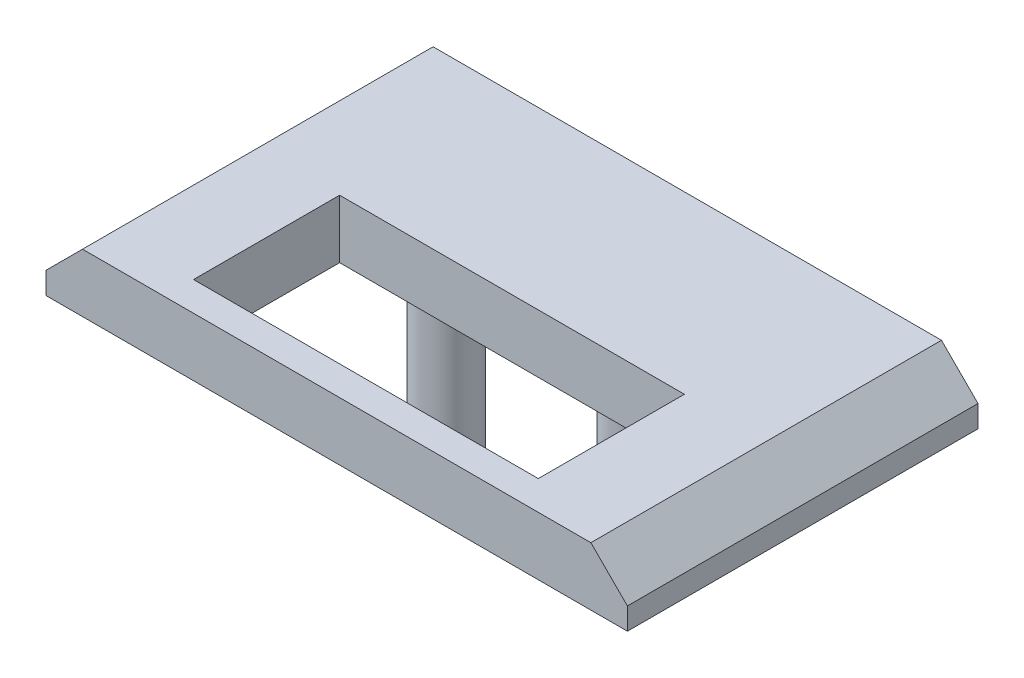
ISO-10303-21;
HEADER;
FILE_DESCRIPTION(('STEP AP214'),'2;1');
FILE_NAME('part.step','',(''),(''),'','','');
FILE_SCHEMA(('AUTOMOTIVE_DESIGN { 1 0 10303 214 1 1 1 1 }'));
ENDSEC;
DATA;
#1=APPLICATION_CONTEXT('core data for automotive mechanical design processes');
#2=APPLICATION_PROTOCOL_DEFINITION('international standard','automotive_design',2000,#1);
#3=PRODUCT_CONTEXT('',#1,'mechanical');
#4=PRODUCT('Part','Part','',(#3));
#5=PRODUCT_RELATED_PRODUCT_CATEGORY('part','',(#4));
#6=PRODUCT_DEFINITION_FORMATION('','',#4);
#7=PRODUCT_DEFINITION_CONTEXT('part definition',#1,'design');
#8=PRODUCT_DEFINITION('design','',#6,#7);
#9=PRODUCT_DEFINITION_SHAPE('','',#8);
#10=(LENGTH_UNIT() NAMED_UNIT(*) SI_UNIT(.MILLI.,.METRE.));
#11=(NAMED_UNIT(*) PLANE_ANGLE_UNIT() SI_UNIT($,.RADIAN.));
#12=(NAMED_UNIT(*) SI_UNIT($,.STERADIAN.) SOLID_ANGLE_UNIT());
#13=UNCERTAINTY_MEASURE_WITH_UNIT(LENGTH_MEASURE(1.E-05),#10,'distance_accuracy_value','');
#14=(GEOMETRIC_REPRESENTATION_CONTEXT(3) GLOBAL_UNCERTAINTY_ASSIGNED_CONTEXT((#13)) GLOBAL_UNIT_ASSIGNED_CONTEXT((#10,
#11,#12)) REPRESENTATION_CONTEXT('',''));
#15=CARTESIAN_POINT('',(0.,0.,0.));
#16=DIRECTION('',(0.,0.,1.));
#17=DIRECTION('',(1.,0.,0.));
#18=AXIS2_PLACEMENT_3D('',#15,#16,#17);
#19=CARTESIAN_POINT('',(9.95,2.,6.));
#20=DIRECTION('',(-1.,0.,0.));
#21=DIRECTION('',(0.,0.,1.));
#22=AXIS2_PLACEMENT_3D('',#19,#20,#21);
#23=PLANE('',#22);
#24=DIRECTION('',(0.,-1.,0.));
#25=VECTOR('',#24,1.);
#26=CARTESIAN_POINT('',(9.95,2.,-6.));
#27=LINE('',#26,#25);
#28=CARTESIAN_POINT('',(9.95,0.749999999999995,-6.));
#29=VERTEX_POINT('',#28);
#30=CARTESIAN_POINT('',(9.95,0.,-6.));
#31=VERTEX_POINT('',#30);
#32=EDGE_CURVE('E191',#29,#31,#27,.T.);
#33=ORIENTED_EDGE('',*,*,#32,.F.);
#34=DIRECTION('',(0.,0.,1.));
#35=VECTOR('',#34,1.);
#36=CARTESIAN_POINT('',(9.95,0.749999999999995,6.));
#37=LINE('',#36,#35);
#38=CARTESIAN_POINT('',(9.95,0.749999999999995,6.));
#39=VERTEX_POINT('',#38);
#40=EDGE_CURVE('E65',#29,#39,#37,.T.);
#41=ORIENTED_EDGE('',*,*,#40,.T.);
#42=DIRECTION('',(0.,-1.,0.));
#43=VECTOR('',#42,1.);
#44=CARTESIAN_POINT('',(9.95,2.,6.));
#45=LINE('',#44,#43);
#46=CARTESIAN_POINT('',(9.95,0.,6.));
#47=VERTEX_POINT('',#46);
#48=EDGE_CURVE('E175',#39,#47,#45,.T.);
#49=ORIENTED_EDGE('',*,*,#48,.T.);
#50=DIRECTION('',(0.,0.,-1.));
#51=VECTOR('',#50,1.);
#52=CARTESIAN_POINT('',(9.95,0.,6.));
#53=LINE('',#52,#51);
#54=EDGE_CURVE('E164',#47,#31,#53,.T.);
#55=ORIENTED_EDGE('',*,*,#54,.T.);
#56=EDGE_LOOP('',(#33,#41,#49,#55));
#57=FACE_BOUND('',#56,.T.);
#58=ADVANCED_FACE('F41',(#57),#23,.F.);
#59=CARTESIAN_POINT('',(-9.95,2.,-6.));
#60=DIRECTION('',(0.,0.,1.));
#61=DIRECTION('',(1.,0.,0.));
#62=AXIS2_PLACEMENT_3D('',#59,#60,#61);
#63=PLANE('',#62);
#64=DIRECTION('',(-1.,0.,0.));
#65=VECTOR('',#64,1.);
#66=CARTESIAN_POINT('',(-9.95,2.,-6.));
#67=LINE('',#66,#65);
#68=CARTESIAN_POINT('',(8.69999999999999,2.,-6.));
#69=VERTEX_POINT('',#68);
#70=CARTESIAN_POINT('',(-8.70000000000001,2.,-6.));
#71=VERTEX_POINT('',#70);
#72=EDGE_CURVE('E168',#69,#71,#67,.T.);
#73=ORIENTED_EDGE('',*,*,#72,.F.);
#74=DIRECTION('',(-0.707106781186546,0.70710678118655,0.));
#75=VECTOR('',#74,1.);
#76=CARTESIAN_POINT('',(8.7,2.,-6.));
#77=LINE('',#76,#75);
#78=EDGE_CURVE('E201',#69,#29,#77,.F.);
#79=ORIENTED_EDGE('',*,*,#78,.T.);
#80=ORIENTED_EDGE('',*,*,#32,.T.);
#81=DIRECTION('',(-1.,0.,0.));
#82=VECTOR('',#81,1.);
#83=CARTESIAN_POINT('',(-9.95,0.,-6.));
#84=LINE('',#83,#82);
#85=CARTESIAN_POINT('',(-9.95,0.,-6.));
#86=VERTEX_POINT('',#85);
#87=EDGE_CURVE('E178',#31,#86,#84,.T.);
#88=ORIENTED_EDGE('',*,*,#87,.T.);
#89=DIRECTION('',(0.,-1.,0.));
#90=VECTOR('',#89,1.);
#91=CARTESIAN_POINT('',(-9.95,2.,-6.));
#92=LINE('',#91,#90);
#93=CARTESIAN_POINT('',(-9.95,0.749999999999999,-6.));
#94=VERTEX_POINT('',#93);
#95=EDGE_CURVE('E189',#94,#86,#92,.T.);
#96=ORIENTED_EDGE('',*,*,#95,.F.);
#97=DIRECTION('',(-0.707106781186546,-0.707106781186549,0.));
#98=VECTOR('',#97,1.);
#99=CARTESIAN_POINT('',(-8.70000000000001,2.,-6.));
#100=LINE('',#99,#98);
#101=EDGE_CURVE('E199',#94,#71,#100,.F.);
#102=ORIENTED_EDGE('',*,*,#101,.T.);
#103=EDGE_LOOP('',(#73,#79,#80,#88,#96,#102));
#104=FACE_BOUND('',#103,.T.);
#105=ADVANCED_FACE('F229',(#104),#63,.F.);
#106=CARTESIAN_POINT('',(-9.95,2.,6.));
#107=DIRECTION('',(1.,0.,0.));
#108=DIRECTION('',(0.,0.,-1.));
#109=AXIS2_PLACEMENT_3D('',#106,#107,#108);
#110=PLANE('',#109);
#111=DIRECTION('',(0.,-1.,0.));
#112=VECTOR('',#111,1.);
#113=CARTESIAN_POINT('',(-9.95,2.,6.));
#114=LINE('',#113,#112);
#115=CARTESIAN_POINT('',(-9.95,0.749999999999999,6.));
#116=VERTEX_POINT('',#115);
#117=CARTESIAN_POINT('',(-9.95,0.,6.));
#118=VERTEX_POINT('',#117);
#119=EDGE_CURVE('E187',#116,#118,#114,.T.);
#120=ORIENTED_EDGE('',*,*,#119,.F.);
#121=DIRECTION('',(0.,0.,-1.));
#122=VECTOR('',#121,1.);
#123=CARTESIAN_POINT('',(-9.95,0.749999999999999,6.));
#124=LINE('',#123,#122);
#125=EDGE_CURVE('E207',#116,#94,#124,.T.);
#126=ORIENTED_EDGE('',*,*,#125,.T.);
#127=ORIENTED_EDGE('',*,*,#95,.T.);
#128=DIRECTION('',(0.,0.,1.));
#129=VECTOR('',#128,1.);
#130=CARTESIAN_POINT('',(-9.95,0.,6.));
#131=LINE('',#130,#129);
#132=EDGE_CURVE('E181',#86,#118,#131,.T.);
#133=ORIENTED_EDGE('',*,*,#132,.T.);
#134=EDGE_LOOP('',(#120,#126,#127,#133));
#135=FACE_BOUND('',#134,.T.);
#136=ADVANCED_FACE('F235',(#135),#110,.F.);
#137=CARTESIAN_POINT('',(-9.95,2.,6.));
#138=DIRECTION('',(0.,0.,-1.));
#139=DIRECTION('',(-1.,0.,0.));
#140=AXIS2_PLACEMENT_3D('',#137,#138,#139);
#141=PLANE('',#140);
#142=ORIENTED_EDGE('',*,*,#48,.F.);
#143=DIRECTION('',(0.707106781186546,-0.70710678118655,0.));
#144=VECTOR('',#143,1.);
#145=CARTESIAN_POINT('',(8.7,2.,6.));
#146=LINE('',#145,#144);
#147=CARTESIAN_POINT('',(8.69999999999999,2.,6.));
#148=VERTEX_POINT('',#147);
#149=EDGE_CURVE('E205',#39,#148,#146,.F.);
#150=ORIENTED_EDGE('',*,*,#149,.T.);
#151=DIRECTION('',(1.,0.,0.));
#152=VECTOR('',#151,1.);
#153=CARTESIAN_POINT('',(-9.95,2.,6.));
#154=LINE('',#153,#152);
#155=CARTESIAN_POINT('',(-8.70000000000001,2.,6.));
#156=VERTEX_POINT('',#155);
#157=EDGE_CURVE('E171',#156,#148,#154,.T.);
#158=ORIENTED_EDGE('',*,*,#157,.F.);
#159=DIRECTION('',(0.707106781186546,0.707106781186549,0.));
#160=VECTOR('',#159,1.);
#161=CARTESIAN_POINT('',(-8.70000000000001,2.,6.));
#162=LINE('',#161,#160);
#163=EDGE_CURVE('E57',#156,#116,#162,.F.);
#164=ORIENTED_EDGE('',*,*,#163,.T.);
#165=ORIENTED_EDGE('',*,*,#119,.T.);
#166=DIRECTION('',(1.,0.,0.));
#167=VECTOR('',#166,1.);
#168=CARTESIAN_POINT('',(-9.95,0.,6.));
#169=LINE('',#168,#167);
#170=EDGE_CURVE('E172',#118,#47,#169,.T.);
#171=ORIENTED_EDGE('',*,*,#170,.T.);
#172=EDGE_LOOP('',(#142,#150,#158,#164,#165,#171));
#173=FACE_BOUND('',#172,.T.);
#174=ADVANCED_FACE('F279',(#173),#141,.F.);
#175=CARTESIAN_POINT('',(0.,2.,0.));
#176=DIRECTION('',(0.,-1.,0.));
#177=DIRECTION('',(0.,0.,-1.));
#178=AXIS2_PLACEMENT_3D('',#175,#176,#177);
#179=PLANE('',#178);
#180=DIRECTION('',(-1.,0.,0.));
#181=VECTOR('',#180,1.);
#182=CARTESIAN_POINT('',(-5.9,2.,0.));
#183=LINE('',#182,#181);
#184=CARTESIAN_POINT('',(5.9,2.,0.));
#185=VERTEX_POINT('',#184);
#186=CARTESIAN_POINT('',(-5.9,2.,0.));
#187=VERTEX_POINT('',#186);
#188=EDGE_CURVE('E157',#185,#187,#183,.T.);
#189=ORIENTED_EDGE('',*,*,#188,.F.);
#190=DIRECTION('',(0.,0.,-1.));
#191=VECTOR('',#190,1.);
#192=CARTESIAN_POINT('',(5.9,2.,5.));
#193=LINE('',#192,#191);
#194=CARTESIAN_POINT('',(5.9,2.,5.));
#195=VERTEX_POINT('',#194);
#196=EDGE_CURVE('E127',#195,#185,#193,.T.);
#197=ORIENTED_EDGE('',*,*,#196,.F.);
#198=DIRECTION('',(1.,0.,0.));
#199=VECTOR('',#198,1.);
#200=CARTESIAN_POINT('',(-5.9,2.,5.));
#201=LINE('',#200,#199);
#202=CARTESIAN_POINT('',(-5.9,2.,5.));
#203=VERTEX_POINT('',#202);
#204=EDGE_CURVE('E145',#203,#195,#201,.T.);
#205=ORIENTED_EDGE('',*,*,#204,.F.);
#206=DIRECTION('',(0.,0.,1.));
#207=VECTOR('',#206,1.);
#208=CARTESIAN_POINT('',(-5.9,2.,5.));
#209=LINE('',#208,#207);
#210=EDGE_CURVE('E148',#187,#203,#209,.T.);
#211=ORIENTED_EDGE('',*,*,#210,.F.);
#212=EDGE_LOOP('',(#189,#197,#205,#211));
#213=FACE_BOUND('',#212,.T.);
#214=ORIENTED_EDGE('',*,*,#157,.T.);
#215=DIRECTION('',(0.,0.,-1.));
#216=VECTOR('',#215,1.);
#217=CARTESIAN_POINT('',(8.7,2.,0.));
#218=LINE('',#217,#216);
#219=EDGE_CURVE('E196',#148,#69,#218,.T.);
#220=ORIENTED_EDGE('',*,*,#219,.T.);
#221=ORIENTED_EDGE('',*,*,#72,.T.);
#222=DIRECTION('',(0.,0.,1.));
#223=VECTOR('',#222,1.);
#224=CARTESIAN_POINT('',(-8.70000000000001,2.,0.));
#225=LINE('',#224,#223);
#226=EDGE_CURVE('E193',#71,#156,#225,.T.);
#227=ORIENTED_EDGE('',*,*,#226,.T.);
#228=EDGE_LOOP('',(#214,#220,#221,#227));
#229=FACE_BOUND('',#228,.T.);
#230=ADVANCED_FACE('F271',(#213,#229),#179,.F.);
#231=CARTESIAN_POINT('',(0.,0.,0.));
#232=DIRECTION('',(0.,-1.,0.));
#233=DIRECTION('',(0.,0.,-1.));
#234=AXIS2_PLACEMENT_3D('',#231,#232,#233);
#235=PLANE('',#234);
#236=CARTESIAN_POINT('',(-3.25,0.,-0.999999999999999));
#237=DIRECTION('',(0.,-1.,0.));
#238=DIRECTION('',(0.,0.,-1.));
#239=AXIS2_PLACEMENT_3D('',#236,#237,#238);
#240=CIRCLE('',#239,0.95);
#241=CARTESIAN_POINT('',(-3.25,0.,-1.95));
#242=VERTEX_POINT('',#241);
#243=EDGE_CURVE('E158',#242,#242,#240,.T.);
#244=ORIENTED_EDGE('',*,*,#243,.F.);
#245=EDGE_LOOP('',(#244));
#246=FACE_BOUND('',#245,.T.);
#247=CARTESIAN_POINT('',(3.25,0.,-0.999999999999999));
#248=DIRECTION('',(0.,-1.,0.));
#249=DIRECTION('',(0.,0.,-1.));
#250=AXIS2_PLACEMENT_3D('',#247,#248,#249);
#251=CIRCLE('',#250,0.95);
#252=CARTESIAN_POINT('',(3.25,0.,-1.95));
#253=VERTEX_POINT('',#252);
#254=EDGE_CURVE('E151',#253,#253,#251,.T.);
#255=ORIENTED_EDGE('',*,*,#254,.F.);
#256=EDGE_LOOP('',(#255));
#257=FACE_BOUND('',#256,.T.);
#258=DIRECTION('',(0.,0.,-1.));
#259=VECTOR('',#258,1.);
#260=CARTESIAN_POINT('',(5.9,0.,5.));
#261=LINE('',#260,#259);
#262=CARTESIAN_POINT('',(5.9,0.,5.));
#263=VERTEX_POINT('',#262);
#264=CARTESIAN_POINT('',(5.9,0.,0.));
#265=VERTEX_POINT('',#264);
#266=EDGE_CURVE('E124',#263,#265,#261,.T.);
#267=ORIENTED_EDGE('',*,*,#266,.T.);
#268=DIRECTION('',(-1.,0.,0.));
#269=VECTOR('',#268,1.);
#270=CARTESIAN_POINT('',(-5.9,0.,0.));
#271=LINE('',#270,#269);
#272=CARTESIAN_POINT('',(-5.9,0.,0.));
#273=VERTEX_POINT('',#272);
#274=EDGE_CURVE('E136',#265,#273,#271,.T.);
#275=ORIENTED_EDGE('',*,*,#274,.T.);
#276=DIRECTION('',(0.,0.,1.));
#277=VECTOR('',#276,1.);
#278=CARTESIAN_POINT('',(-5.9,0.,5.));
#279=LINE('',#278,#277);
#280=CARTESIAN_POINT('',(-5.9,0.,5.));
#281=VERTEX_POINT('',#280);
#282=EDGE_CURVE('E140',#273,#281,#279,.T.);
#283=ORIENTED_EDGE('',*,*,#282,.T.);
#284=DIRECTION('',(1.,0.,0.));
#285=VECTOR('',#284,1.);
#286=CARTESIAN_POINT('',(-5.9,0.,5.));
#287=LINE('',#286,#285);
#288=EDGE_CURVE('E132',#281,#263,#287,.T.);
#289=ORIENTED_EDGE('',*,*,#288,.T.);
#290=EDGE_LOOP('',(#267,#275,#283,#289));
#291=FACE_BOUND('',#290,.T.);
#292=ORIENTED_EDGE('',*,*,#54,.F.);
#293=ORIENTED_EDGE('',*,*,#170,.F.);
#294=ORIENTED_EDGE('',*,*,#132,.F.);
#295=ORIENTED_EDGE('',*,*,#87,.F.);
#296=EDGE_LOOP('',(#292,#293,#294,#295));
#297=FACE_BOUND('',#296,.T.);
#298=ADVANCED_FACE('F142',(#246,#257,#291,#297),#235,.T.);
#299=CARTESIAN_POINT('',(5.9,0.,5.));
#300=DIRECTION('',(1.,0.,0.));
#301=DIRECTION('',(0.,0.,-1.));
#302=AXIS2_PLACEMENT_3D('',#299,#300,#301);
#303=PLANE('',#302);
#304=ORIENTED_EDGE('',*,*,#196,.T.);
#305=DIRECTION('',(0.,1.,0.));
#306=VECTOR('',#305,1.);
#307=CARTESIAN_POINT('',(5.9,0.,0.));
#308=LINE('',#307,#306);
#309=EDGE_CURVE('E120',#265,#185,#308,.T.);
#310=ORIENTED_EDGE('',*,*,#309,.F.);
#311=ORIENTED_EDGE('',*,*,#266,.F.);
#312=DIRECTION('',(0.,1.,0.));
#313=VECTOR('',#312,1.);
#314=CARTESIAN_POINT('',(5.9,0.,5.));
#315=LINE('',#314,#313);
#316=EDGE_CURVE('E162',#263,#195,#315,.T.);
#317=ORIENTED_EDGE('',*,*,#316,.T.);
#318=EDGE_LOOP('',(#304,#310,#311,#317));
#319=FACE_BOUND('',#318,.T.);
#320=ADVANCED_FACE('F122',(#319),#303,.F.);
#321=CARTESIAN_POINT('',(-5.9,0.,5.));
#322=DIRECTION('',(0.,0.,1.));
#323=DIRECTION('',(1.,0.,0.));
#324=AXIS2_PLACEMENT_3D('',#321,#322,#323);
#325=PLANE('',#324);
#326=ORIENTED_EDGE('',*,*,#204,.T.);
#327=ORIENTED_EDGE('',*,*,#316,.F.);
#328=ORIENTED_EDGE('',*,*,#288,.F.);
#329=DIRECTION('',(0.,1.,0.));
#330=VECTOR('',#329,1.);
#331=CARTESIAN_POINT('',(-5.9,0.,5.));
#332=LINE('',#331,#330);
#333=EDGE_CURVE('E165',#281,#203,#332,.T.);
#334=ORIENTED_EDGE('',*,*,#333,.T.);
#335=EDGE_LOOP('',(#326,#327,#328,#334));
#336=FACE_BOUND('',#335,.T.);
#337=ADVANCED_FACE('F293',(#336),#325,.F.);
#338=CARTESIAN_POINT('',(-5.9,0.,5.));
#339=DIRECTION('',(-1.,0.,0.));
#340=DIRECTION('',(0.,0.,1.));
#341=AXIS2_PLACEMENT_3D('',#338,#339,#340);
#342=PLANE('',#341);
#343=ORIENTED_EDGE('',*,*,#210,.T.);
#344=ORIENTED_EDGE('',*,*,#333,.F.);
#345=ORIENTED_EDGE('',*,*,#282,.F.);
#346=DIRECTION('',(0.,1.,0.));
#347=VECTOR('',#346,1.);
#348=CARTESIAN_POINT('',(-5.9,0.,0.));
#349=LINE('',#348,#347);
#350=EDGE_CURVE('E131',#273,#187,#349,.T.);
#351=ORIENTED_EDGE('',*,*,#350,.T.);
#352=EDGE_LOOP('',(#343,#344,#345,#351));
#353=FACE_BOUND('',#352,.T.);
#354=ADVANCED_FACE('F295',(#353),#342,.F.);
#355=CARTESIAN_POINT('',(-5.9,0.,0.));
#356=DIRECTION('',(0.,0.,-1.));
#357=DIRECTION('',(-1.,0.,0.));
#358=AXIS2_PLACEMENT_3D('',#355,#356,#357);
#359=PLANE('',#358);
#360=ORIENTED_EDGE('',*,*,#188,.T.);
#361=ORIENTED_EDGE('',*,*,#350,.F.);
#362=ORIENTED_EDGE('',*,*,#274,.F.);
#363=ORIENTED_EDGE('',*,*,#309,.T.);
#364=EDGE_LOOP('',(#360,#361,#362,#363));
#365=FACE_BOUND('',#364,.T.);
#366=ADVANCED_FACE('F137',(#365),#359,.F.);
#367=CARTESIAN_POINT('',(8.7,2.,0.));
#368=DIRECTION('',(-0.707106781186549,-0.707106781186545,0.));
#369=DIRECTION('',(0.,0.,-1.));
#370=AXIS2_PLACEMENT_3D('',#367,#368,#369);
#371=PLANE('',#370);
#372=ORIENTED_EDGE('',*,*,#149,.F.);
#373=ORIENTED_EDGE('',*,*,#40,.F.);
#374=ORIENTED_EDGE('',*,*,#78,.F.);
#375=ORIENTED_EDGE('',*,*,#219,.F.);
#376=EDGE_LOOP('',(#372,#373,#374,#375));
#377=FACE_BOUND('',#376,.T.);
#378=ADVANCED_FACE('F241',(#377),#371,.F.);
#379=CARTESIAN_POINT('',(-8.70000000000001,2.,0.));
#380=DIRECTION('',(0.707106781186549,-0.707106781186546,0.));
#381=DIRECTION('',(0.,0.,1.));
#382=AXIS2_PLACEMENT_3D('',#379,#380,#381);
#383=PLANE('',#382);
#384=ORIENTED_EDGE('',*,*,#101,.F.);
#385=ORIENTED_EDGE('',*,*,#125,.F.);
#386=ORIENTED_EDGE('',*,*,#163,.F.);
#387=ORIENTED_EDGE('',*,*,#226,.F.);
#388=EDGE_LOOP('',(#384,#385,#386,#387));
#389=FACE_BOUND('',#388,.T.);
#390=ADVANCED_FACE('F247',(#389),#383,.F.);
#391=CARTESIAN_POINT('',(3.25,-5.6,-0.999999999999999));
#392=DIRECTION('',(0.,1.,0.));
#393=DIRECTION('',(0.,0.,1.));
#394=AXIS2_PLACEMENT_3D('',#391,#392,#393);
#395=CYLINDRICAL_SURFACE('',#394,0.95);
#396=CARTESIAN_POINT('',(3.25,-5.4,-0.999999999999999));
#397=DIRECTION('',(0.,-1.,0.));
#398=DIRECTION('',(0.,0.,-1.));
#399=AXIS2_PLACEMENT_3D('',#396,#397,#398);
#400=CIRCLE('',#399,0.95);
#401=CARTESIAN_POINT('',(3.25,-5.4,-1.95));
#402=VERTEX_POINT('',#401);
#403=EDGE_CURVE('E11',#402,#402,#400,.F.);
#404=ORIENTED_EDGE('',*,*,#403,.T.);
#405=EDGE_LOOP('',(#404));
#406=FACE_BOUND('',#405,.T.);
#407=ORIENTED_EDGE('',*,*,#254,.T.);
#408=EDGE_LOOP('',(#407));
#409=FACE_BOUND('',#408,.T.);
#410=ADVANCED_FACE('F253',(#406,#409),#395,.T.);
#411=CARTESIAN_POINT('',(3.25,-5.6,-0.999999999999999));
#412=DIRECTION('',(0.,-1.,0.));
#413=DIRECTION('',(0.,0.,-1.));
#414=AXIS2_PLACEMENT_3D('',#411,#412,#413);
#415=PLANE('',#414);
#416=CARTESIAN_POINT('',(3.25,-5.6,-0.999999999999999));
#417=DIRECTION('',(0.,-1.,0.));
#418=DIRECTION('',(0.,0.,-1.));
#419=AXIS2_PLACEMENT_3D('',#416,#417,#418);
#420=CIRCLE('',#419,0.749999999999997);
#421=CARTESIAN_POINT('',(3.25,-5.6,-1.75));
#422=VERTEX_POINT('',#421);
#423=EDGE_CURVE('E50',#422,#422,#420,.T.);
#424=ORIENTED_EDGE('',*,*,#423,.T.);
#425=EDGE_LOOP('',(#424));
#426=FACE_BOUND('',#425,.T.);
#427=ADVANCED_FACE('F217',(#426),#415,.T.);
#428=CARTESIAN_POINT('',(-3.25,-5.6,-0.999999999999999));
#429=DIRECTION('',(0.,1.,0.));
#430=DIRECTION('',(0.,0.,1.));
#431=AXIS2_PLACEMENT_3D('',#428,#429,#430);
#432=CYLINDRICAL_SURFACE('',#431,0.95);
#433=CARTESIAN_POINT('',(-3.25,-5.4,-0.999999999999999));
#434=DIRECTION('',(0.,-1.,0.));
#435=DIRECTION('',(0.,0.,-1.));
#436=AXIS2_PLACEMENT_3D('',#433,#434,#435);
#437=CIRCLE('',#436,0.95);
#438=CARTESIAN_POINT('',(-3.25,-5.4,-1.95));
#439=VERTEX_POINT('',#438);
#440=EDGE_CURVE('E212',#439,#439,#437,.F.);
#441=ORIENTED_EDGE('',*,*,#440,.T.);
#442=EDGE_LOOP('',(#441));
#443=FACE_BOUND('',#442,.T.);
#444=ORIENTED_EDGE('',*,*,#243,.T.);
#445=EDGE_LOOP('',(#444));
#446=FACE_BOUND('',#445,.T.);
#447=ADVANCED_FACE('F303',(#443,#446),#432,.T.);
#448=CARTESIAN_POINT('',(-3.25,-5.6,-0.999999999999999));
#449=DIRECTION('',(0.,-1.,0.));
#450=DIRECTION('',(0.,0.,-1.));
#451=AXIS2_PLACEMENT_3D('',#448,#449,#450);
#452=PLANE('',#451);
#453=CARTESIAN_POINT('',(-3.25,-5.6,-0.999999999999999));
#454=DIRECTION('',(0.,-1.,0.));
#455=DIRECTION('',(0.,0.,-1.));
#456=AXIS2_PLACEMENT_3D('',#453,#454,#455);
#457=CIRCLE('',#456,0.750000000000004);
#458=CARTESIAN_POINT('',(-3.25,-5.6,-1.75));
#459=VERTEX_POINT('',#458);
#460=EDGE_CURVE('E209',#459,#459,#457,.T.);
#461=ORIENTED_EDGE('',*,*,#460,.T.);
#462=EDGE_LOOP('',(#461));
#463=FACE_BOUND('',#462,.T.);
#464=ADVANCED_FACE('F225',(#463),#452,.T.);
#465=CARTESIAN_POINT('',(-3.25,-5.6,-0.999999999999999));
#466=DIRECTION('',(0.,1.,0.));
#467=DIRECTION('',(0.,0.,1.));
#468=AXIS2_PLACEMENT_3D('',#465,#466,#467);
#469=CONICAL_SURFACE('',#468,0.750000000000004,0.785398163397448);
#470=ORIENTED_EDGE('',*,*,#440,.F.);
#471=EDGE_LOOP('',(#470));
#472=FACE_BOUND('',#471,.T.);
#473=ORIENTED_EDGE('',*,*,#460,.F.);
#474=EDGE_LOOP('',(#473));
#475=FACE_BOUND('',#474,.T.);
#476=ADVANCED_FACE('F220',(#472,#475),#469,.T.);
#477=CARTESIAN_POINT('',(3.25,-5.6,-0.999999999999999));
#478=DIRECTION('',(0.,1.,0.));
#479=DIRECTION('',(0.,0.,1.));
#480=AXIS2_PLACEMENT_3D('',#477,#478,#479);
#481=CONICAL_SURFACE('',#480,0.749999999999997,0.785398163397449);
#482=ORIENTED_EDGE('',*,*,#403,.F.);
#483=EDGE_LOOP('',(#482));
#484=FACE_BOUND('',#483,.T.);
#485=ORIENTED_EDGE('',*,*,#423,.F.);
#486=EDGE_LOOP('',(#485));
#487=FACE_BOUND('',#486,.T.);
#488=ADVANCED_FACE('F44',(#484,#487),#481,.T.);
#489=CLOSED_SHELL('',(#58,#105,#136,#174,#230,#298,#320,#337,#354,#366,#378,#390,#410,#427,#447,
#464,#476,#488));
#490=MANIFOLD_SOLID_BREP('B2',#489);
#491=ADVANCED_BREP_SHAPE_REPRESENTATION('',(#18,#490),#14);
#492=SHAPE_DEFINITION_REPRESENTATION(#9,#491);
ENDSEC;
END-ISO-10303-21;
